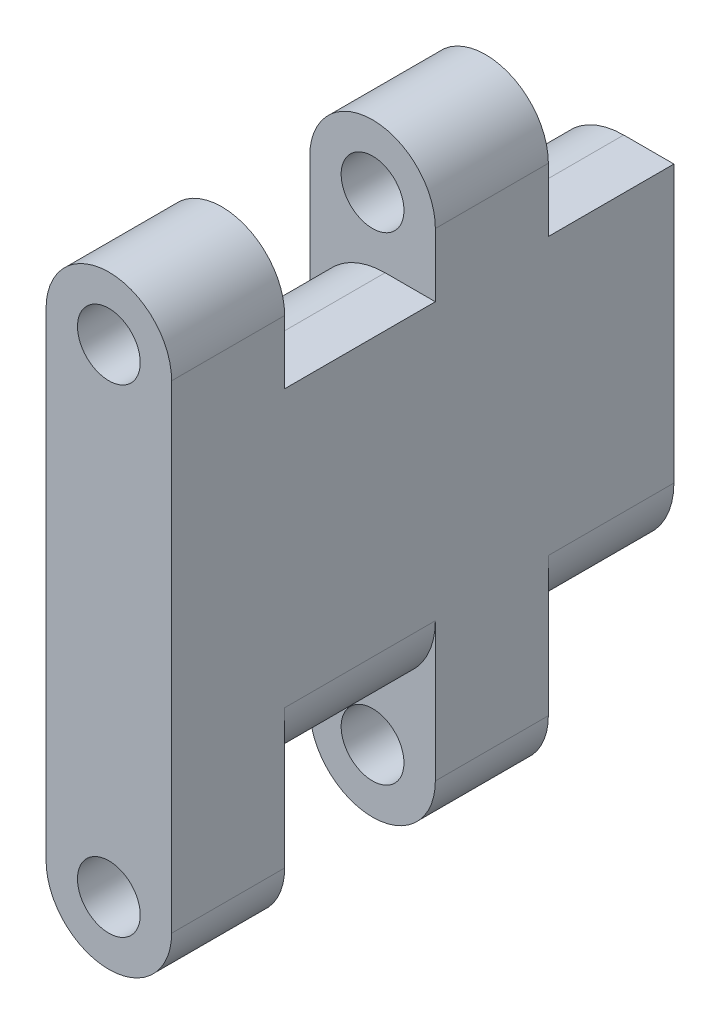
ISO-10303-21;
HEADER;
FILE_DESCRIPTION(('STEP AP214'),'2;1');
FILE_NAME('part.step','',(''),(''),'','','');
FILE_SCHEMA(('AUTOMOTIVE_DESIGN { 1 0 10303 214 1 1 1 1 }'));
ENDSEC;
DATA;
#1=APPLICATION_CONTEXT('core data for automotive mechanical design processes');
#2=APPLICATION_PROTOCOL_DEFINITION('international standard','automotive_design',2000,#1);
#3=PRODUCT_CONTEXT('',#1,'mechanical');
#4=PRODUCT('Part','Part','',(#3));
#5=PRODUCT_RELATED_PRODUCT_CATEGORY('part','',(#4));
#6=PRODUCT_DEFINITION_FORMATION('','',#4);
#7=PRODUCT_DEFINITION_CONTEXT('part definition',#1,'design');
#8=PRODUCT_DEFINITION('design','',#6,#7);
#9=PRODUCT_DEFINITION_SHAPE('','',#8);
#10=(LENGTH_UNIT() NAMED_UNIT(*) SI_UNIT(.MILLI.,.METRE.));
#11=(NAMED_UNIT(*) PLANE_ANGLE_UNIT() SI_UNIT($,.RADIAN.));
#12=(NAMED_UNIT(*) SI_UNIT($,.STERADIAN.) SOLID_ANGLE_UNIT());
#13=UNCERTAINTY_MEASURE_WITH_UNIT(LENGTH_MEASURE(1.E-05),#10,'distance_accuracy_value','');
#14=(GEOMETRIC_REPRESENTATION_CONTEXT(3) GLOBAL_UNCERTAINTY_ASSIGNED_CONTEXT((#13)) GLOBAL_UNIT_ASSIGNED_CONTEXT((#10,
#11,#12)) REPRESENTATION_CONTEXT('',''));
#15=CARTESIAN_POINT('',(0.,0.,0.));
#16=DIRECTION('',(0.,0.,1.));
#17=DIRECTION('',(1.,0.,0.));
#18=AXIS2_PLACEMENT_3D('',#15,#16,#17);
#19=CARTESIAN_POINT('',(10.,14.,20.));
#20=DIRECTION('',(0.,-1.,0.));
#21=DIRECTION('',(0.,0.,-1.));
#22=AXIS2_PLACEMENT_3D('',#19,#20,#21);
#23=PLANE('',#22);
#24=DIRECTION('',(-1.,0.,0.));
#25=VECTOR('',#24,1.);
#26=CARTESIAN_POINT('',(10.,14.,-20.));
#27=LINE('',#26,#25);
#28=CARTESIAN_POINT('',(10.,14.,-20.));
#29=VERTEX_POINT('',#28);
#30=CARTESIAN_POINT('',(6.,14.,-20.));
#31=VERTEX_POINT('',#30);
#32=EDGE_CURVE('E350',#29,#31,#27,.T.);
#33=ORIENTED_EDGE('',*,*,#32,.T.);
#34=DIRECTION('',(0.,0.,1.));
#35=VECTOR('',#34,1.);
#36=CARTESIAN_POINT('',(6.,14.,20.));
#37=LINE('',#36,#35);
#38=CARTESIAN_POINT('',(6.,14.,-10.));
#39=VERTEX_POINT('',#38);
#40=EDGE_CURVE('E354',#31,#39,#37,.T.);
#41=ORIENTED_EDGE('',*,*,#40,.T.);
#42=DIRECTION('',(-1.,0.,0.));
#43=VECTOR('',#42,1.);
#44=CARTESIAN_POINT('',(10.,14.,-10.));
#45=LINE('',#44,#43);
#46=CARTESIAN_POINT('',(10.,14.,-10.));
#47=VERTEX_POINT('',#46);
#48=EDGE_CURVE('E258',#47,#39,#45,.T.);
#49=ORIENTED_EDGE('',*,*,#48,.F.);
#50=DIRECTION('',(0.,0.,1.));
#51=VECTOR('',#50,1.);
#52=CARTESIAN_POINT('',(10.,14.,20.));
#53=LINE('',#52,#51);
#54=EDGE_CURVE('E330',#29,#47,#53,.T.);
#55=ORIENTED_EDGE('',*,*,#54,.F.);
#56=EDGE_LOOP('',(#33,#41,#49,#55));
#57=FACE_BOUND('',#56,.T.);
#58=ADVANCED_FACE('F45',(#57),#23,.F.);
#59=CARTESIAN_POINT('',(10.,-14.,20.));
#60=DIRECTION('',(0.,1.,0.));
#61=DIRECTION('',(0.,0.,1.));
#62=AXIS2_PLACEMENT_3D('',#59,#60,#61);
#63=PLANE('',#62);
#64=DIRECTION('',(-1.,0.,0.));
#65=VECTOR('',#64,1.);
#66=CARTESIAN_POINT('',(10.,-14.,-20.));
#67=LINE('',#66,#65);
#68=CARTESIAN_POINT('',(4.,-14.,-20.));
#69=VERTEX_POINT('',#68);
#70=CARTESIAN_POINT('',(0.,-14.,-20.));
#71=VERTEX_POINT('',#70);
#72=EDGE_CURVE('E337',#69,#71,#67,.T.);
#73=ORIENTED_EDGE('',*,*,#72,.F.);
#74=DIRECTION('',(0.,0.,-1.));
#75=VECTOR('',#74,1.);
#76=CARTESIAN_POINT('',(4.,-14.,-10.));
#77=LINE('',#76,#75);
#78=CARTESIAN_POINT('',(4.,-14.,-10.));
#79=VERTEX_POINT('',#78);
#80=EDGE_CURVE('E382',#69,#79,#77,.F.);
#81=ORIENTED_EDGE('',*,*,#80,.T.);
#82=DIRECTION('',(1.,0.,0.));
#83=VECTOR('',#82,1.);
#84=CARTESIAN_POINT('',(10.,-14.,-10.));
#85=LINE('',#84,#83);
#86=CARTESIAN_POINT('',(0.,-14.,-10.));
#87=VERTEX_POINT('',#86);
#88=EDGE_CURVE('E254',#87,#79,#85,.T.);
#89=ORIENTED_EDGE('',*,*,#88,.F.);
#90=DIRECTION('',(0.,0.,-1.));
#91=VECTOR('',#90,1.);
#92=CARTESIAN_POINT('',(0.,-14.,20.));
#93=LINE('',#92,#91);
#94=EDGE_CURVE('E344',#87,#71,#93,.T.);
#95=ORIENTED_EDGE('',*,*,#94,.T.);
#96=EDGE_LOOP('',(#73,#81,#89,#95));
#97=FACE_BOUND('',#96,.T.);
#98=ADVANCED_FACE('F426',(#97),#63,.F.);
#99=DIRECTION('',(-1.,0.,0.));
#100=VECTOR('',#99,1.);
#101=CARTESIAN_POINT('',(10.,14.,-1.));
#102=LINE('',#101,#100);
#103=CARTESIAN_POINT('',(10.,14.,-1.));
#104=VERTEX_POINT('',#103);
#105=CARTESIAN_POINT('',(6.,14.,-1.));
#106=VERTEX_POINT('',#105);
#107=EDGE_CURVE('E250',#104,#106,#102,.T.);
#108=ORIENTED_EDGE('',*,*,#107,.T.);
#109=DIRECTION('',(0.,0.,1.));
#110=VECTOR('',#109,1.);
#111=CARTESIAN_POINT('',(6.,14.,20.));
#112=LINE('',#111,#110);
#113=CARTESIAN_POINT('',(6.,14.,11.));
#114=VERTEX_POINT('',#113);
#115=EDGE_CURVE('E370',#106,#114,#112,.T.);
#116=ORIENTED_EDGE('',*,*,#115,.T.);
#117=DIRECTION('',(-1.,0.,0.));
#118=VECTOR('',#117,1.);
#119=CARTESIAN_POINT('',(10.,14.,11.));
#120=LINE('',#119,#118);
#121=CARTESIAN_POINT('',(10.,14.,11.));
#122=VERTEX_POINT('',#121);
#123=EDGE_CURVE('E320',#122,#114,#120,.T.);
#124=ORIENTED_EDGE('',*,*,#123,.F.);
#125=EDGE_CURVE('E328',#104,#122,#53,.T.);
#126=ORIENTED_EDGE('',*,*,#125,.F.);
#127=EDGE_LOOP('',(#108,#116,#124,#126));
#128=FACE_BOUND('',#127,.T.);
#129=ADVANCED_FACE('F474',(#128),#23,.F.);
#130=DIRECTION('',(1.,0.,0.));
#131=VECTOR('',#130,1.);
#132=CARTESIAN_POINT('',(10.,-14.,-1.));
#133=LINE('',#132,#131);
#134=CARTESIAN_POINT('',(0.,-14.,-1.));
#135=VERTEX_POINT('',#134);
#136=CARTESIAN_POINT('',(4.,-14.,-1.));
#137=VERTEX_POINT('',#136);
#138=EDGE_CURVE('E241',#135,#137,#133,.T.);
#139=ORIENTED_EDGE('',*,*,#138,.T.);
#140=DIRECTION('',(0.,0.,-1.));
#141=VECTOR('',#140,1.);
#142=CARTESIAN_POINT('',(4.,-14.,11.));
#143=LINE('',#142,#141);
#144=CARTESIAN_POINT('',(4.,-14.,11.));
#145=VERTEX_POINT('',#144);
#146=EDGE_CURVE('E61',#137,#145,#143,.F.);
#147=ORIENTED_EDGE('',*,*,#146,.T.);
#148=DIRECTION('',(1.,0.,0.));
#149=VECTOR('',#148,1.);
#150=CARTESIAN_POINT('',(10.,-14.,11.));
#151=LINE('',#150,#149);
#152=CARTESIAN_POINT('',(0.,-14.,11.));
#153=VERTEX_POINT('',#152);
#154=EDGE_CURVE('E306',#153,#145,#151,.T.);
#155=ORIENTED_EDGE('',*,*,#154,.F.);
#156=EDGE_CURVE('E329',#153,#135,#93,.T.);
#157=ORIENTED_EDGE('',*,*,#156,.T.);
#158=EDGE_LOOP('',(#139,#147,#155,#157));
#159=FACE_BOUND('',#158,.T.);
#160=ADVANCED_FACE('F479',(#159),#63,.F.);
#161=CARTESIAN_POINT('',(10.,14.,-20.));
#162=DIRECTION('',(0.,0.,1.));
#163=DIRECTION('',(0.,-1.,0.));
#164=AXIS2_PLACEMENT_3D('',#161,#162,#163);
#165=PLANE('',#164);
#166=DIRECTION('',(0.,1.,0.));
#167=VECTOR('',#166,1.);
#168=CARTESIAN_POINT('',(0.,14.,-20.));
#169=LINE('',#168,#167);
#170=CARTESIAN_POINT('',(0.,8.,-20.));
#171=VERTEX_POINT('',#170);
#172=EDGE_CURVE('E324',#71,#171,#169,.T.);
#173=ORIENTED_EDGE('',*,*,#172,.T.);
#174=CARTESIAN_POINT('',(6.,8.,-20.));
#175=DIRECTION('',(0.,0.,1.));
#176=DIRECTION('',(0.,-1.,0.));
#177=AXIS2_PLACEMENT_3D('',#174,#175,#176);
#178=CIRCLE('',#177,6.);
#179=EDGE_CURVE('E367',#171,#31,#178,.F.);
#180=ORIENTED_EDGE('',*,*,#179,.T.);
#181=ORIENTED_EDGE('',*,*,#32,.F.);
#182=DIRECTION('',(0.,1.,0.));
#183=VECTOR('',#182,1.);
#184=CARTESIAN_POINT('',(10.,14.,-20.));
#185=LINE('',#184,#183);
#186=CARTESIAN_POINT('',(10.,-8.,-20.));
#187=VERTEX_POINT('',#186);
#188=EDGE_CURVE('E325',#187,#29,#185,.T.);
#189=ORIENTED_EDGE('',*,*,#188,.F.);
#190=CARTESIAN_POINT('',(4.,-8.,-20.));
#191=DIRECTION('',(0.,0.,1.));
#192=DIRECTION('',(0.,-1.,0.));
#193=AXIS2_PLACEMENT_3D('',#190,#191,#192);
#194=CIRCLE('',#193,6.);
#195=EDGE_CURVE('E364',#187,#69,#194,.F.);
#196=ORIENTED_EDGE('',*,*,#195,.T.);
#197=ORIENTED_EDGE('',*,*,#72,.T.);
#198=EDGE_LOOP('',(#173,#180,#181,#189,#196,#197));
#199=FACE_BOUND('',#198,.T.);
#200=ADVANCED_FACE('F420',(#199),#165,.F.);
#201=CARTESIAN_POINT('',(10.,14.,20.));
#202=DIRECTION('',(0.,0.,-1.));
#203=DIRECTION('',(-1.,0.,0.));
#204=AXIS2_PLACEMENT_3D('',#201,#202,#203);
#205=PLANE('',#204);
#206=DIRECTION('',(0.,-1.,0.));
#207=VECTOR('',#206,1.);
#208=CARTESIAN_POINT('',(0.,14.,20.));
#209=LINE('',#208,#207);
#210=CARTESIAN_POINT('',(0.,19.05,20.));
#211=VERTEX_POINT('',#210);
#212=CARTESIAN_POINT('',(0.,-19.05,20.));
#213=VERTEX_POINT('',#212);
#214=EDGE_CURVE('E341',#211,#213,#209,.T.);
#215=ORIENTED_EDGE('',*,*,#214,.T.);
#216=CARTESIAN_POINT('',(5.,-19.05,20.));
#217=DIRECTION('',(0.,0.,1.));
#218=DIRECTION('',(1.,0.,0.));
#219=AXIS2_PLACEMENT_3D('',#216,#217,#218);
#220=CIRCLE('',#219,5.);
#221=CARTESIAN_POINT('',(10.,-19.05,20.));
#222=VERTEX_POINT('',#221);
#223=EDGE_CURVE('E283',#213,#222,#220,.T.);
#224=ORIENTED_EDGE('',*,*,#223,.T.);
#225=DIRECTION('',(0.,-1.,0.));
#226=VECTOR('',#225,1.);
#227=CARTESIAN_POINT('',(10.,14.,20.));
#228=LINE('',#227,#226);
#229=CARTESIAN_POINT('',(10.,19.05,20.));
#230=VERTEX_POINT('',#229);
#231=EDGE_CURVE('E334',#230,#222,#228,.T.);
#232=ORIENTED_EDGE('',*,*,#231,.F.);
#233=CARTESIAN_POINT('',(4.99999999999999,19.05,20.));
#234=DIRECTION('',(0.,0.,1.));
#235=DIRECTION('',(1.,0.,0.));
#236=AXIS2_PLACEMENT_3D('',#233,#234,#235);
#237=CIRCLE('',#236,5.);
#238=EDGE_CURVE('E274',#230,#211,#237,.T.);
#239=ORIENTED_EDGE('',*,*,#238,.T.);
#240=EDGE_LOOP('',(#215,#224,#232,#239));
#241=FACE_BOUND('',#240,.T.);
#242=CARTESIAN_POINT('',(5.,-19.05,20.));
#243=DIRECTION('',(0.,0.,1.));
#244=DIRECTION('',(1.,0.,0.));
#245=AXIS2_PLACEMENT_3D('',#242,#243,#244);
#246=CIRCLE('',#245,2.5);
#247=CARTESIAN_POINT('',(7.5,-19.05,20.));
#248=VERTEX_POINT('',#247);
#249=EDGE_CURVE('E261',#248,#248,#246,.T.);
#250=ORIENTED_EDGE('',*,*,#249,.F.);
#251=EDGE_LOOP('',(#250));
#252=FACE_BOUND('',#251,.T.);
#253=CARTESIAN_POINT('',(4.99999999999999,19.05,20.));
#254=DIRECTION('',(0.,0.,1.));
#255=DIRECTION('',(1.,0.,0.));
#256=AXIS2_PLACEMENT_3D('',#253,#254,#255);
#257=CIRCLE('',#256,2.5);
#258=CARTESIAN_POINT('',(7.49999999999999,19.05,20.));
#259=VERTEX_POINT('',#258);
#260=EDGE_CURVE('E266',#259,#259,#257,.T.);
#261=ORIENTED_EDGE('',*,*,#260,.F.);
#262=EDGE_LOOP('',(#261));
#263=FACE_BOUND('',#262,.T.);
#264=ADVANCED_FACE('F505',(#241,#252,#263),#205,.F.);
#265=CARTESIAN_POINT('',(10.,0.,0.));
#266=DIRECTION('',(1.,0.,0.));
#267=DIRECTION('',(0.,0.,-1.));
#268=AXIS2_PLACEMENT_3D('',#265,#266,#267);
#269=PLANE('',#268);
#270=DIRECTION('',(0.,1.,0.));
#271=VECTOR('',#270,1.);
#272=CARTESIAN_POINT('',(10.,19.05,-10.));
#273=LINE('',#272,#271);
#274=CARTESIAN_POINT('',(10.,-19.05,-10.));
#275=VERTEX_POINT('',#274);
#276=CARTESIAN_POINT('',(10.,-8.,-10.));
#277=VERTEX_POINT('',#276);
#278=EDGE_CURVE('E194',#275,#277,#273,.T.);
#279=ORIENTED_EDGE('',*,*,#278,.T.);
#280=DIRECTION('',(0.,0.,-1.));
#281=VECTOR('',#280,1.);
#282=CARTESIAN_POINT('',(10.,-8.,-20.));
#283=LINE('',#282,#281);
#284=EDGE_CURVE('E378',#277,#187,#283,.T.);
#285=ORIENTED_EDGE('',*,*,#284,.T.);
#286=ORIENTED_EDGE('',*,*,#188,.T.);
#287=ORIENTED_EDGE('',*,*,#54,.T.);
#288=CARTESIAN_POINT('',(10.,19.05,-10.));
#289=VERTEX_POINT('',#288);
#290=EDGE_CURVE('E225',#47,#289,#273,.T.);
#291=ORIENTED_EDGE('',*,*,#290,.T.);
#292=DIRECTION('',(0.,0.,1.));
#293=VECTOR('',#292,1.);
#294=CARTESIAN_POINT('',(10.,19.05,-10.));
#295=LINE('',#294,#293);
#296=CARTESIAN_POINT('',(10.,19.05,-1.));
#297=VERTEX_POINT('',#296);
#298=EDGE_CURVE('E210',#289,#297,#295,.T.);
#299=ORIENTED_EDGE('',*,*,#298,.T.);
#300=DIRECTION('',(0.,1.,0.));
#301=VECTOR('',#300,1.);
#302=CARTESIAN_POINT('',(10.,19.05,-1.));
#303=LINE('',#302,#301);
#304=EDGE_CURVE('E216',#104,#297,#303,.T.);
#305=ORIENTED_EDGE('',*,*,#304,.F.);
#306=ORIENTED_EDGE('',*,*,#125,.T.);
#307=DIRECTION('',(0.,1.,0.));
#308=VECTOR('',#307,1.);
#309=CARTESIAN_POINT('',(10.,19.05,11.));
#310=LINE('',#309,#308);
#311=CARTESIAN_POINT('',(10.,19.05,11.));
#312=VERTEX_POINT('',#311);
#313=EDGE_CURVE('E291',#122,#312,#310,.T.);
#314=ORIENTED_EDGE('',*,*,#313,.T.);
#315=DIRECTION('',(0.,0.,1.));
#316=VECTOR('',#315,1.);
#317=CARTESIAN_POINT('',(10.,19.05,11.));
#318=LINE('',#317,#316);
#319=EDGE_CURVE('E302',#312,#230,#318,.T.);
#320=ORIENTED_EDGE('',*,*,#319,.T.);
#321=ORIENTED_EDGE('',*,*,#231,.T.);
#322=DIRECTION('',(0.,0.,1.));
#323=VECTOR('',#322,1.);
#324=CARTESIAN_POINT('',(10.,-19.05,11.));
#325=LINE('',#324,#323);
#326=CARTESIAN_POINT('',(10.,-19.05,11.));
#327=VERTEX_POINT('',#326);
#328=EDGE_CURVE('E307',#327,#222,#325,.T.);
#329=ORIENTED_EDGE('',*,*,#328,.F.);
#330=CARTESIAN_POINT('',(10.,-8.,11.));
#331=VERTEX_POINT('',#330);
#332=EDGE_CURVE('E292',#327,#331,#310,.T.);
#333=ORIENTED_EDGE('',*,*,#332,.T.);
#334=DIRECTION('',(0.,0.,-1.));
#335=VECTOR('',#334,1.);
#336=CARTESIAN_POINT('',(10.,-8.,-1.));
#337=LINE('',#336,#335);
#338=CARTESIAN_POINT('',(10.,-8.,-1.));
#339=VERTEX_POINT('',#338);
#340=EDGE_CURVE('E374',#331,#339,#337,.T.);
#341=ORIENTED_EDGE('',*,*,#340,.T.);
#342=CARTESIAN_POINT('',(10.,-19.05,-1.));
#343=VERTEX_POINT('',#342);
#344=EDGE_CURVE('E212',#343,#339,#303,.T.);
#345=ORIENTED_EDGE('',*,*,#344,.F.);
#346=DIRECTION('',(0.,0.,1.));
#347=VECTOR('',#346,1.);
#348=CARTESIAN_POINT('',(10.,-19.05,-10.));
#349=LINE('',#348,#347);
#350=EDGE_CURVE('E242',#275,#343,#349,.T.);
#351=ORIENTED_EDGE('',*,*,#350,.F.);
#352=EDGE_LOOP('',(#279,#285,#286,#287,#291,#299,#305,#306,#314,#320,#321,#329,#333,#341,#345,#351));
#353=FACE_BOUND('',#352,.T.);
#354=ADVANCED_FACE('F407',(#353),#269,.T.);
#355=CARTESIAN_POINT('',(0.,0.,0.));
#356=DIRECTION('',(1.,0.,0.));
#357=DIRECTION('',(0.,0.,-1.));
#358=AXIS2_PLACEMENT_3D('',#355,#356,#357);
#359=PLANE('',#358);
#360=DIRECTION('',(0.,-1.,0.));
#361=VECTOR('',#360,1.);
#362=CARTESIAN_POINT('',(0.,19.05,-10.));
#363=LINE('',#362,#361);
#364=CARTESIAN_POINT('',(0.,19.05,-10.));
#365=VERTEX_POINT('',#364);
#366=CARTESIAN_POINT('',(0.,8.,-10.));
#367=VERTEX_POINT('',#366);
#368=EDGE_CURVE('E184',#365,#367,#363,.T.);
#369=ORIENTED_EDGE('',*,*,#368,.T.);
#370=DIRECTION('',(0.,0.,1.));
#371=VECTOR('',#370,1.);
#372=CARTESIAN_POINT('',(0.,8.,0.));
#373=LINE('',#372,#371);
#374=EDGE_CURVE('E361',#367,#171,#373,.F.);
#375=ORIENTED_EDGE('',*,*,#374,.T.);
#376=ORIENTED_EDGE('',*,*,#172,.F.);
#377=ORIENTED_EDGE('',*,*,#94,.F.);
#378=CARTESIAN_POINT('',(0.,-19.05,-10.));
#379=VERTEX_POINT('',#378);
#380=EDGE_CURVE('E205',#87,#379,#363,.T.);
#381=ORIENTED_EDGE('',*,*,#380,.T.);
#382=DIRECTION('',(0.,0.,1.));
#383=VECTOR('',#382,1.);
#384=CARTESIAN_POINT('',(0.,-19.05,-10.));
#385=LINE('',#384,#383);
#386=CARTESIAN_POINT('',(0.,-19.05,-1.));
#387=VERTEX_POINT('',#386);
#388=EDGE_CURVE('E193',#379,#387,#385,.T.);
#389=ORIENTED_EDGE('',*,*,#388,.T.);
#390=DIRECTION('',(0.,-1.,0.));
#391=VECTOR('',#390,1.);
#392=CARTESIAN_POINT('',(0.,19.05,-1.));
#393=LINE('',#392,#391);
#394=EDGE_CURVE('E231',#135,#387,#393,.T.);
#395=ORIENTED_EDGE('',*,*,#394,.F.);
#396=ORIENTED_EDGE('',*,*,#156,.F.);
#397=DIRECTION('',(0.,-1.,0.));
#398=VECTOR('',#397,1.);
#399=CARTESIAN_POINT('',(0.,19.05,11.));
#400=LINE('',#399,#398);
#401=CARTESIAN_POINT('',(0.,-19.05,11.));
#402=VERTEX_POINT('',#401);
#403=EDGE_CURVE('E282',#153,#402,#400,.T.);
#404=ORIENTED_EDGE('',*,*,#403,.T.);
#405=DIRECTION('',(0.,0.,1.));
#406=VECTOR('',#405,1.);
#407=CARTESIAN_POINT('',(0.,-19.05,11.));
#408=LINE('',#407,#406);
#409=EDGE_CURVE('E311',#402,#213,#408,.T.);
#410=ORIENTED_EDGE('',*,*,#409,.T.);
#411=ORIENTED_EDGE('',*,*,#214,.F.);
#412=DIRECTION('',(0.,0.,1.));
#413=VECTOR('',#412,1.);
#414=CARTESIAN_POINT('',(0.,19.05,11.));
#415=LINE('',#414,#413);
#416=CARTESIAN_POINT('',(0.,19.05,11.));
#417=VERTEX_POINT('',#416);
#418=EDGE_CURVE('E295',#417,#211,#415,.T.);
#419=ORIENTED_EDGE('',*,*,#418,.F.);
#420=CARTESIAN_POINT('',(0.,8.,11.));
#421=VERTEX_POINT('',#420);
#422=EDGE_CURVE('E284',#417,#421,#400,.T.);
#423=ORIENTED_EDGE('',*,*,#422,.T.);
#424=DIRECTION('',(0.,0.,1.));
#425=VECTOR('',#424,1.);
#426=CARTESIAN_POINT('',(0.,8.,0.));
#427=LINE('',#426,#425);
#428=CARTESIAN_POINT('',(0.,8.,-1.));
#429=VERTEX_POINT('',#428);
#430=EDGE_CURVE('E358',#421,#429,#427,.F.);
#431=ORIENTED_EDGE('',*,*,#430,.T.);
#432=CARTESIAN_POINT('',(0.,19.05,-1.));
#433=VERTEX_POINT('',#432);
#434=EDGE_CURVE('E187',#433,#429,#393,.T.);
#435=ORIENTED_EDGE('',*,*,#434,.F.);
#436=DIRECTION('',(0.,0.,1.));
#437=VECTOR('',#436,1.);
#438=CARTESIAN_POINT('',(0.,19.05,-10.));
#439=LINE('',#438,#437);
#440=EDGE_CURVE('E181',#365,#433,#439,.T.);
#441=ORIENTED_EDGE('',*,*,#440,.F.);
#442=EDGE_LOOP('',(#369,#375,#376,#377,#381,#389,#395,#396,#404,#410,#411,#419,#423,#431,#435,#441));
#443=FACE_BOUND('',#442,.T.);
#444=ADVANCED_FACE('F183',(#443),#359,.F.);
#445=CARTESIAN_POINT('',(5.,-19.05,11.));
#446=DIRECTION('',(0.,0.,1.));
#447=DIRECTION('',(1.,0.,0.));
#448=AXIS2_PLACEMENT_3D('',#445,#446,#447);
#449=CYLINDRICAL_SURFACE('',#448,5.);
#450=ORIENTED_EDGE('',*,*,#223,.F.);
#451=ORIENTED_EDGE('',*,*,#409,.F.);
#452=CARTESIAN_POINT('',(5.,-19.05,11.));
#453=DIRECTION('',(0.,0.,1.));
#454=DIRECTION('',(1.,0.,0.));
#455=AXIS2_PLACEMENT_3D('',#452,#453,#454);
#456=CIRCLE('',#455,5.);
#457=EDGE_CURVE('E287',#402,#327,#456,.T.);
#458=ORIENTED_EDGE('',*,*,#457,.T.);
#459=ORIENTED_EDGE('',*,*,#328,.T.);
#460=EDGE_LOOP('',(#450,#451,#458,#459));
#461=FACE_BOUND('',#460,.T.);
#462=ADVANCED_FACE('F509',(#461),#449,.T.);
#463=CARTESIAN_POINT('',(5.,-19.05,11.));
#464=DIRECTION('',(0.,0.,1.));
#465=DIRECTION('',(1.,0.,0.));
#466=AXIS2_PLACEMENT_3D('',#463,#464,#465);
#467=CYLINDRICAL_SURFACE('',#466,2.5);
#468=CARTESIAN_POINT('',(5.,-19.05,11.));
#469=DIRECTION('',(0.,0.,1.));
#470=DIRECTION('',(1.,0.,0.));
#471=AXIS2_PLACEMENT_3D('',#468,#469,#470);
#472=CIRCLE('',#471,2.5);
#473=CARTESIAN_POINT('',(7.5,-19.05,11.));
#474=VERTEX_POINT('',#473);
#475=EDGE_CURVE('E262',#474,#474,#472,.T.);
#476=ORIENTED_EDGE('',*,*,#475,.F.);
#477=EDGE_LOOP('',(#476));
#478=FACE_BOUND('',#477,.T.);
#479=ORIENTED_EDGE('',*,*,#249,.T.);
#480=EDGE_LOOP('',(#479));
#481=FACE_BOUND('',#480,.T.);
#482=ADVANCED_FACE('F548',(#478,#481),#467,.F.);
#483=CARTESIAN_POINT('',(4.99999999999999,19.05,11.));
#484=DIRECTION('',(0.,0.,1.));
#485=DIRECTION('',(1.,0.,0.));
#486=AXIS2_PLACEMENT_3D('',#483,#484,#485);
#487=PLANE('',#486);
#488=ORIENTED_EDGE('',*,*,#475,.T.);
#489=EDGE_LOOP('',(#488));
#490=FACE_BOUND('',#489,.T.);
#491=ORIENTED_EDGE('',*,*,#403,.F.);
#492=ORIENTED_EDGE('',*,*,#154,.T.);
#493=CARTESIAN_POINT('',(4.,-8.,11.));
#494=DIRECTION('',(0.,0.,1.));
#495=DIRECTION('',(1.,0.,0.));
#496=AXIS2_PLACEMENT_3D('',#493,#494,#495);
#497=CIRCLE('',#496,6.);
#498=EDGE_CURVE('E11',#145,#331,#497,.T.);
#499=ORIENTED_EDGE('',*,*,#498,.T.);
#500=ORIENTED_EDGE('',*,*,#332,.F.);
#501=ORIENTED_EDGE('',*,*,#457,.F.);
#502=EDGE_LOOP('',(#491,#492,#499,#500,#501));
#503=FACE_BOUND('',#502,.T.);
#504=ADVANCED_FACE('F515',(#490,#503),#487,.F.);
#505=CARTESIAN_POINT('',(4.99999999999999,19.05,11.));
#506=DIRECTION('',(0.,0.,1.));
#507=DIRECTION('',(1.,0.,0.));
#508=AXIS2_PLACEMENT_3D('',#505,#506,#507);
#509=CIRCLE('',#508,2.5);
#510=CARTESIAN_POINT('',(7.49999999999999,19.05,11.));
#511=VERTEX_POINT('',#510);
#512=EDGE_CURVE('E270',#511,#511,#509,.T.);
#513=ORIENTED_EDGE('',*,*,#512,.T.);
#514=EDGE_LOOP('',(#513));
#515=FACE_BOUND('',#514,.T.);
#516=ORIENTED_EDGE('',*,*,#313,.F.);
#517=ORIENTED_EDGE('',*,*,#123,.T.);
#518=CARTESIAN_POINT('',(6.,8.,11.));
#519=DIRECTION('',(0.,0.,1.));
#520=DIRECTION('',(1.,0.,0.));
#521=AXIS2_PLACEMENT_3D('',#518,#519,#520);
#522=CIRCLE('',#521,6.);
#523=EDGE_CURVE('E389',#114,#421,#522,.T.);
#524=ORIENTED_EDGE('',*,*,#523,.T.);
#525=ORIENTED_EDGE('',*,*,#422,.F.);
#526=CARTESIAN_POINT('',(4.99999999999999,19.05,11.));
#527=DIRECTION('',(0.,0.,1.));
#528=DIRECTION('',(1.,0.,0.));
#529=AXIS2_PLACEMENT_3D('',#526,#527,#528);
#530=CIRCLE('',#529,5.);
#531=EDGE_CURVE('E278',#312,#417,#530,.T.);
#532=ORIENTED_EDGE('',*,*,#531,.F.);
#533=EDGE_LOOP('',(#516,#517,#524,#525,#532));
#534=FACE_BOUND('',#533,.T.);
#535=ADVANCED_FACE('F498',(#515,#534),#487,.F.);
#536=CARTESIAN_POINT('',(4.99999999999999,19.05,11.));
#537=DIRECTION('',(0.,0.,1.));
#538=DIRECTION('',(1.,0.,0.));
#539=AXIS2_PLACEMENT_3D('',#536,#537,#538);
#540=CYLINDRICAL_SURFACE('',#539,5.);
#541=ORIENTED_EDGE('',*,*,#238,.F.);
#542=ORIENTED_EDGE('',*,*,#319,.F.);
#543=ORIENTED_EDGE('',*,*,#531,.T.);
#544=ORIENTED_EDGE('',*,*,#418,.T.);
#545=EDGE_LOOP('',(#541,#542,#543,#544));
#546=FACE_BOUND('',#545,.T.);
#547=ADVANCED_FACE('F503',(#546),#540,.T.);
#548=CARTESIAN_POINT('',(4.99999999999999,19.05,11.));
#549=DIRECTION('',(0.,0.,1.));
#550=DIRECTION('',(1.,0.,0.));
#551=AXIS2_PLACEMENT_3D('',#548,#549,#550);
#552=CYLINDRICAL_SURFACE('',#551,2.5);
#553=ORIENTED_EDGE('',*,*,#512,.F.);
#554=EDGE_LOOP('',(#553));
#555=FACE_BOUND('',#554,.T.);
#556=ORIENTED_EDGE('',*,*,#260,.T.);
#557=EDGE_LOOP('',(#556));
#558=FACE_BOUND('',#557,.T.);
#559=ADVANCED_FACE('F545',(#555,#558),#552,.F.);
#560=CARTESIAN_POINT('',(5.,-19.05,-10.));
#561=DIRECTION('',(0.,0.,1.));
#562=DIRECTION('',(1.,0.,0.));
#563=AXIS2_PLACEMENT_3D('',#560,#561,#562);
#564=CYLINDRICAL_SURFACE('',#563,5.);
#565=CARTESIAN_POINT('',(5.,-19.05,-1.));
#566=DIRECTION('',(0.,0.,1.));
#567=DIRECTION('',(1.,0.,0.));
#568=AXIS2_PLACEMENT_3D('',#565,#566,#567);
#569=CIRCLE('',#568,5.);
#570=EDGE_CURVE('E235',#387,#343,#569,.T.);
#571=ORIENTED_EDGE('',*,*,#570,.F.);
#572=ORIENTED_EDGE('',*,*,#388,.F.);
#573=CARTESIAN_POINT('',(5.,-19.05,-10.));
#574=DIRECTION('',(0.,0.,1.));
#575=DIRECTION('',(1.,0.,0.));
#576=AXIS2_PLACEMENT_3D('',#573,#574,#575);
#577=CIRCLE('',#576,5.);
#578=EDGE_CURVE('E204',#379,#275,#577,.T.);
#579=ORIENTED_EDGE('',*,*,#578,.T.);
#580=ORIENTED_EDGE('',*,*,#350,.T.);
#581=EDGE_LOOP('',(#571,#572,#579,#580));
#582=FACE_BOUND('',#581,.T.);
#583=ADVANCED_FACE('F433',(#582),#564,.T.);
#584=CARTESIAN_POINT('',(5.,-19.05,-10.));
#585=DIRECTION('',(0.,0.,1.));
#586=DIRECTION('',(1.,0.,0.));
#587=AXIS2_PLACEMENT_3D('',#584,#585,#586);
#588=CYLINDRICAL_SURFACE('',#587,2.5);
#589=CARTESIAN_POINT('',(5.,-19.05,-10.));
#590=DIRECTION('',(0.,0.,1.));
#591=DIRECTION('',(1.,0.,0.));
#592=AXIS2_PLACEMENT_3D('',#589,#590,#591);
#593=CIRCLE('',#592,2.5);
#594=CARTESIAN_POINT('',(7.5,-19.05,-10.));
#595=VERTEX_POINT('',#594);
#596=EDGE_CURVE('E447',#595,#595,#593,.T.);
#597=ORIENTED_EDGE('',*,*,#596,.F.);
#598=EDGE_LOOP('',(#597));
#599=FACE_BOUND('',#598,.T.);
#600=CARTESIAN_POINT('',(5.,-19.05,-1.));
#601=DIRECTION('',(0.,0.,1.));
#602=DIRECTION('',(1.,0.,0.));
#603=AXIS2_PLACEMENT_3D('',#600,#601,#602);
#604=CIRCLE('',#603,2.5);
#605=CARTESIAN_POINT('',(7.5,-19.05,-1.));
#606=VERTEX_POINT('',#605);
#607=EDGE_CURVE('E450',#606,#606,#604,.T.);
#608=ORIENTED_EDGE('',*,*,#607,.T.);
#609=EDGE_LOOP('',(#608));
#610=FACE_BOUND('',#609,.T.);
#611=ADVANCED_FACE('F456',(#599,#610),#588,.F.);
#612=CARTESIAN_POINT('',(4.99999999999999,19.05,-1.));
#613=DIRECTION('',(0.,0.,1.));
#614=DIRECTION('',(1.,0.,0.));
#615=AXIS2_PLACEMENT_3D('',#612,#613,#614);
#616=PLANE('',#615);
#617=ORIENTED_EDGE('',*,*,#607,.F.);
#618=EDGE_LOOP('',(#617));
#619=FACE_BOUND('',#618,.T.);
#620=ORIENTED_EDGE('',*,*,#138,.F.);
#621=ORIENTED_EDGE('',*,*,#394,.T.);
#622=ORIENTED_EDGE('',*,*,#570,.T.);
#623=ORIENTED_EDGE('',*,*,#344,.T.);
#624=CARTESIAN_POINT('',(4.,-8.,-1.));
#625=DIRECTION('',(0.,0.,1.));
#626=DIRECTION('',(1.,0.,0.));
#627=AXIS2_PLACEMENT_3D('',#624,#625,#626);
#628=CIRCLE('',#627,6.);
#629=EDGE_CURVE('E54',#339,#137,#628,.F.);
#630=ORIENTED_EDGE('',*,*,#629,.T.);
#631=EDGE_LOOP('',(#620,#621,#622,#623,#630));
#632=FACE_BOUND('',#631,.T.);
#633=ADVANCED_FACE('F439',(#619,#632),#616,.T.);
#634=CARTESIAN_POINT('',(4.99999999999999,19.05,-10.));
#635=DIRECTION('',(0.,0.,1.));
#636=DIRECTION('',(1.,0.,0.));
#637=AXIS2_PLACEMENT_3D('',#634,#635,#636);
#638=PLANE('',#637);
#639=ORIENTED_EDGE('',*,*,#596,.T.);
#640=EDGE_LOOP('',(#639));
#641=FACE_BOUND('',#640,.T.);
#642=ORIENTED_EDGE('',*,*,#380,.F.);
#643=ORIENTED_EDGE('',*,*,#88,.T.);
#644=CARTESIAN_POINT('',(4.,-8.,-10.));
#645=DIRECTION('',(0.,0.,1.));
#646=DIRECTION('',(1.,0.,0.));
#647=AXIS2_PLACEMENT_3D('',#644,#645,#646);
#648=CIRCLE('',#647,6.);
#649=EDGE_CURVE('E396',#79,#277,#648,.T.);
#650=ORIENTED_EDGE('',*,*,#649,.T.);
#651=ORIENTED_EDGE('',*,*,#278,.F.);
#652=ORIENTED_EDGE('',*,*,#578,.F.);
#653=EDGE_LOOP('',(#642,#643,#650,#651,#652));
#654=FACE_BOUND('',#653,.T.);
#655=ADVANCED_FACE('F435',(#641,#654),#638,.F.);
#656=CARTESIAN_POINT('',(4.99999999999999,19.05,-10.));
#657=DIRECTION('',(0.,0.,1.));
#658=DIRECTION('',(1.,0.,0.));
#659=AXIS2_PLACEMENT_3D('',#656,#657,#658);
#660=CIRCLE('',#659,2.5);
#661=CARTESIAN_POINT('',(7.49999999999999,19.05,-10.));
#662=VERTEX_POINT('',#661);
#663=EDGE_CURVE('E232',#662,#662,#660,.T.);
#664=ORIENTED_EDGE('',*,*,#663,.T.);
#665=EDGE_LOOP('',(#664));
#666=FACE_BOUND('',#665,.T.);
#667=ORIENTED_EDGE('',*,*,#290,.F.);
#668=ORIENTED_EDGE('',*,*,#48,.T.);
#669=CARTESIAN_POINT('',(6.,8.,-10.));
#670=DIRECTION('',(0.,0.,1.));
#671=DIRECTION('',(1.,0.,0.));
#672=AXIS2_PLACEMENT_3D('',#669,#670,#671);
#673=CIRCLE('',#672,6.);
#674=EDGE_CURVE('E201',#39,#367,#673,.T.);
#675=ORIENTED_EDGE('',*,*,#674,.T.);
#676=ORIENTED_EDGE('',*,*,#368,.F.);
#677=CARTESIAN_POINT('',(4.99999999999999,19.05,-10.));
#678=DIRECTION('',(0.,0.,1.));
#679=DIRECTION('',(1.,0.,0.));
#680=AXIS2_PLACEMENT_3D('',#677,#678,#679);
#681=CIRCLE('',#680,5.);
#682=EDGE_CURVE('E199',#289,#365,#681,.T.);
#683=ORIENTED_EDGE('',*,*,#682,.F.);
#684=EDGE_LOOP('',(#667,#668,#675,#676,#683));
#685=FACE_BOUND('',#684,.T.);
#686=ADVANCED_FACE('F198',(#666,#685),#638,.F.);
#687=CARTESIAN_POINT('',(4.99999999999999,19.05,-1.));
#688=DIRECTION('',(0.,0.,1.));
#689=DIRECTION('',(1.,0.,0.));
#690=AXIS2_PLACEMENT_3D('',#687,#688,#689);
#691=CIRCLE('',#690,2.5);
#692=CARTESIAN_POINT('',(7.49999999999999,19.05,-1.));
#693=VERTEX_POINT('',#692);
#694=EDGE_CURVE('E219',#693,#693,#691,.T.);
#695=ORIENTED_EDGE('',*,*,#694,.F.);
#696=EDGE_LOOP('',(#695));
#697=FACE_BOUND('',#696,.T.);
#698=ORIENTED_EDGE('',*,*,#107,.F.);
#699=ORIENTED_EDGE('',*,*,#304,.T.);
#700=CARTESIAN_POINT('',(4.99999999999999,19.05,-1.));
#701=DIRECTION('',(0.,0.,1.));
#702=DIRECTION('',(1.,0.,0.));
#703=AXIS2_PLACEMENT_3D('',#700,#701,#702);
#704=CIRCLE('',#703,5.);
#705=EDGE_CURVE('E228',#297,#433,#704,.T.);
#706=ORIENTED_EDGE('',*,*,#705,.T.);
#707=ORIENTED_EDGE('',*,*,#434,.T.);
#708=CARTESIAN_POINT('',(6.,8.,-1.));
#709=DIRECTION('',(0.,0.,1.));
#710=DIRECTION('',(1.,0.,0.));
#711=AXIS2_PLACEMENT_3D('',#708,#709,#710);
#712=CIRCLE('',#711,6.);
#713=EDGE_CURVE('E393',#429,#106,#712,.F.);
#714=ORIENTED_EDGE('',*,*,#713,.T.);
#715=EDGE_LOOP('',(#698,#699,#706,#707,#714));
#716=FACE_BOUND('',#715,.T.);
#717=ADVANCED_FACE('F460',(#697,#716),#616,.T.);
#718=CARTESIAN_POINT('',(4.99999999999999,19.05,-10.));
#719=DIRECTION('',(0.,0.,1.));
#720=DIRECTION('',(1.,0.,0.));
#721=AXIS2_PLACEMENT_3D('',#718,#719,#720);
#722=CYLINDRICAL_SURFACE('',#721,5.);
#723=ORIENTED_EDGE('',*,*,#705,.F.);
#724=ORIENTED_EDGE('',*,*,#298,.F.);
#725=ORIENTED_EDGE('',*,*,#682,.T.);
#726=ORIENTED_EDGE('',*,*,#440,.T.);
#727=EDGE_LOOP('',(#723,#724,#725,#726));
#728=FACE_BOUND('',#727,.T.);
#729=ADVANCED_FACE('F208',(#728),#722,.T.);
#730=CARTESIAN_POINT('',(4.99999999999999,19.05,-10.));
#731=DIRECTION('',(0.,0.,1.));
#732=DIRECTION('',(1.,0.,0.));
#733=AXIS2_PLACEMENT_3D('',#730,#731,#732);
#734=CYLINDRICAL_SURFACE('',#733,2.5);
#735=ORIENTED_EDGE('',*,*,#663,.F.);
#736=EDGE_LOOP('',(#735));
#737=FACE_BOUND('',#736,.T.);
#738=ORIENTED_EDGE('',*,*,#694,.T.);
#739=EDGE_LOOP('',(#738));
#740=FACE_BOUND('',#739,.T.);
#741=ADVANCED_FACE('F531',(#737,#740),#734,.F.);
#742=CARTESIAN_POINT('',(6.,8.,20.));
#743=DIRECTION('',(0.,0.,1.));
#744=DIRECTION('',(1.,0.,0.));
#745=AXIS2_PLACEMENT_3D('',#742,#743,#744);
#746=CYLINDRICAL_SURFACE('',#745,6.);
#747=ORIENTED_EDGE('',*,*,#179,.F.);
#748=ORIENTED_EDGE('',*,*,#374,.F.);
#749=ORIENTED_EDGE('',*,*,#674,.F.);
#750=ORIENTED_EDGE('',*,*,#40,.F.);
#751=EDGE_LOOP('',(#747,#748,#749,#750));
#752=FACE_BOUND('',#751,.T.);
#753=ADVANCED_FACE('F416',(#752),#746,.T.);
#754=CARTESIAN_POINT('',(6.,8.,20.));
#755=DIRECTION('',(0.,0.,1.));
#756=DIRECTION('',(1.,0.,0.));
#757=AXIS2_PLACEMENT_3D('',#754,#755,#756);
#758=CYLINDRICAL_SURFACE('',#757,6.);
#759=ORIENTED_EDGE('',*,*,#713,.F.);
#760=ORIENTED_EDGE('',*,*,#430,.F.);
#761=ORIENTED_EDGE('',*,*,#523,.F.);
#762=ORIENTED_EDGE('',*,*,#115,.F.);
#763=EDGE_LOOP('',(#759,#760,#761,#762));
#764=FACE_BOUND('',#763,.T.);
#765=ADVANCED_FACE('F493',(#764),#758,.T.);
#766=CARTESIAN_POINT('',(4.,-8.,0.));
#767=DIRECTION('',(0.,0.,1.));
#768=DIRECTION('',(1.,0.,0.));
#769=AXIS2_PLACEMENT_3D('',#766,#767,#768);
#770=CYLINDRICAL_SURFACE('',#769,6.);
#771=ORIENTED_EDGE('',*,*,#649,.F.);
#772=ORIENTED_EDGE('',*,*,#80,.F.);
#773=ORIENTED_EDGE('',*,*,#195,.F.);
#774=ORIENTED_EDGE('',*,*,#284,.F.);
#775=EDGE_LOOP('',(#771,#772,#773,#774));
#776=FACE_BOUND('',#775,.T.);
#777=ADVANCED_FACE('F520',(#776),#770,.T.);
#778=CARTESIAN_POINT('',(4.,-8.,0.));
#779=DIRECTION('',(0.,0.,1.));
#780=DIRECTION('',(1.,0.,0.));
#781=AXIS2_PLACEMENT_3D('',#778,#779,#780);
#782=CYLINDRICAL_SURFACE('',#781,6.);
#783=ORIENTED_EDGE('',*,*,#498,.F.);
#784=ORIENTED_EDGE('',*,*,#146,.F.);
#785=ORIENTED_EDGE('',*,*,#629,.F.);
#786=ORIENTED_EDGE('',*,*,#340,.F.);
#787=EDGE_LOOP('',(#783,#784,#785,#786));
#788=FACE_BOUND('',#787,.T.);
#789=ADVANCED_FACE('F47',(#788),#782,.T.);
#790=CLOSED_SHELL('',(#58,#98,#129,#160,#200,#264,#354,#444,#462,#482,#504,#535,#547,#559,#583,
#611,#633,#655,#686,#717,#729,#741,#753,#765,#777,#789));
#791=MANIFOLD_SOLID_BREP('B2',#790);
#792=ADVANCED_BREP_SHAPE_REPRESENTATION('',(#18,#791),#14);
#793=SHAPE_DEFINITION_REPRESENTATION(#9,#792);
ENDSEC;
END-ISO-10303-21;
